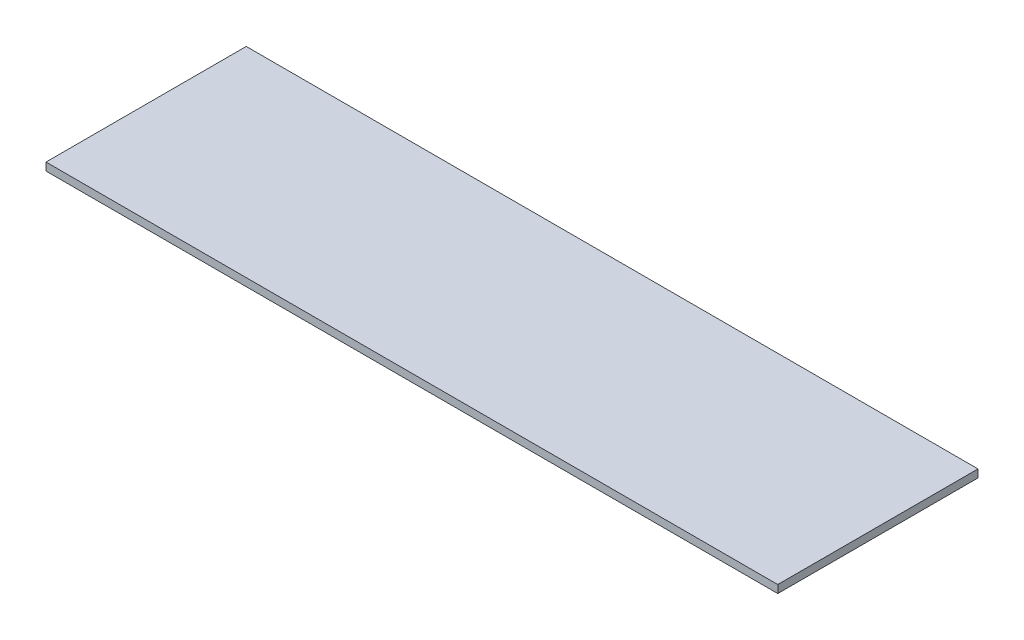
ISO-10303-21;
HEADER;
FILE_DESCRIPTION(('STEP AP214'),'2;1');
FILE_NAME('part.step','',(''),(''),'','','');
FILE_SCHEMA(('AUTOMOTIVE_DESIGN { 1 0 10303 214 1 1 1 1 }'));
ENDSEC;
DATA;
#1=APPLICATION_CONTEXT('core data for automotive mechanical design processes');
#2=APPLICATION_PROTOCOL_DEFINITION('international standard','automotive_design',2000,#1);
#3=PRODUCT_CONTEXT('',#1,'mechanical');
#4=PRODUCT('Part','Part','',(#3));
#5=PRODUCT_RELATED_PRODUCT_CATEGORY('part','',(#4));
#6=PRODUCT_DEFINITION_FORMATION('','',#4);
#7=PRODUCT_DEFINITION_CONTEXT('part definition',#1,'design');
#8=PRODUCT_DEFINITION('design','',#6,#7);
#9=PRODUCT_DEFINITION_SHAPE('','',#8);
#10=(LENGTH_UNIT() NAMED_UNIT(*) SI_UNIT(.MILLI.,.METRE.));
#11=(NAMED_UNIT(*) PLANE_ANGLE_UNIT() SI_UNIT($,.RADIAN.));
#12=(NAMED_UNIT(*) SI_UNIT($,.STERADIAN.) SOLID_ANGLE_UNIT());
#13=UNCERTAINTY_MEASURE_WITH_UNIT(LENGTH_MEASURE(1.E-05),#10,'distance_accuracy_value','');
#14=(GEOMETRIC_REPRESENTATION_CONTEXT(3) GLOBAL_UNCERTAINTY_ASSIGNED_CONTEXT((#13)) GLOBAL_UNIT_ASSIGNED_CONTEXT((#10,
#11,#12)) REPRESENTATION_CONTEXT('',''));
#15=CARTESIAN_POINT('',(0.,0.,0.));
#16=DIRECTION('',(0.,0.,1.));
#17=DIRECTION('',(1.,0.,0.));
#18=AXIS2_PLACEMENT_3D('',#15,#16,#17);
#19=CARTESIAN_POINT('',(0.,2.9972,0.));
#20=DIRECTION('',(1.,0.,0.));
#21=DIRECTION('',(0.,0.,-1.));
#22=AXIS2_PLACEMENT_3D('',#19,#20,#21);
#23=PLANE('',#22);
#24=DIRECTION('',(0.,0.,1.));
#25=VECTOR('',#24,1.);
#26=CARTESIAN_POINT('',(0.,0.,0.));
#27=LINE('',#26,#25);
#28=CARTESIAN_POINT('',(0.,0.,0.));
#29=VERTEX_POINT('',#28);
#30=CARTESIAN_POINT('',(0.,0.,76.5556));
#31=VERTEX_POINT('',#30);
#32=EDGE_CURVE('E98',#29,#31,#27,.T.);
#33=ORIENTED_EDGE('',*,*,#32,.T.);
#34=DIRECTION('',(0.,-1.,0.));
#35=VECTOR('',#34,1.);
#36=CARTESIAN_POINT('',(0.,2.9972,76.5556));
#37=LINE('',#36,#35);
#38=CARTESIAN_POINT('',(0.,2.9972,76.5556));
#39=VERTEX_POINT('',#38);
#40=EDGE_CURVE('E11',#39,#31,#37,.T.);
#41=ORIENTED_EDGE('',*,*,#40,.F.);
#42=DIRECTION('',(0.,0.,1.));
#43=VECTOR('',#42,1.);
#44=CARTESIAN_POINT('',(0.,2.9972,0.));
#45=LINE('',#44,#43);
#46=CARTESIAN_POINT('',(0.,2.9972,0.));
#47=VERTEX_POINT('',#46);
#48=EDGE_CURVE('E86',#47,#39,#45,.T.);
#49=ORIENTED_EDGE('',*,*,#48,.F.);
#50=DIRECTION('',(0.,-1.,0.));
#51=VECTOR('',#50,1.);
#52=CARTESIAN_POINT('',(0.,2.9972,0.));
#53=LINE('',#52,#51);
#54=EDGE_CURVE('E94',#47,#29,#53,.T.);
#55=ORIENTED_EDGE('',*,*,#54,.T.);
#56=EDGE_LOOP('',(#33,#41,#49,#55));
#57=FACE_BOUND('',#56,.T.);
#58=ADVANCED_FACE('F35',(#57),#23,.F.);
#59=CARTESIAN_POINT('',(0.,2.9972,76.5556));
#60=DIRECTION('',(0.,0.,-1.));
#61=DIRECTION('',(-1.,0.,0.));
#62=AXIS2_PLACEMENT_3D('',#59,#60,#61);
#63=PLANE('',#62);
#64=DIRECTION('',(1.,0.,0.));
#65=VECTOR('',#64,1.);
#66=CARTESIAN_POINT('',(0.,0.,76.5556));
#67=LINE('',#66,#65);
#68=CARTESIAN_POINT('',(279.7556,0.,76.5556));
#69=VERTEX_POINT('',#68);
#70=EDGE_CURVE('E90',#31,#69,#67,.T.);
#71=ORIENTED_EDGE('',*,*,#70,.T.);
#72=DIRECTION('',(0.,-1.,0.));
#73=VECTOR('',#72,1.);
#74=CARTESIAN_POINT('',(279.7556,2.9972,76.5556));
#75=LINE('',#74,#73);
#76=CARTESIAN_POINT('',(279.7556,2.9972,76.5556));
#77=VERTEX_POINT('',#76);
#78=EDGE_CURVE('E43',#77,#69,#75,.T.);
#79=ORIENTED_EDGE('',*,*,#78,.F.);
#80=DIRECTION('',(1.,0.,0.));
#81=VECTOR('',#80,1.);
#82=CARTESIAN_POINT('',(0.,2.9972,76.5556));
#83=LINE('',#82,#81);
#84=EDGE_CURVE('E81',#39,#77,#83,.T.);
#85=ORIENTED_EDGE('',*,*,#84,.F.);
#86=ORIENTED_EDGE('',*,*,#40,.T.);
#87=EDGE_LOOP('',(#71,#79,#85,#86));
#88=FACE_BOUND('',#87,.T.);
#89=ADVANCED_FACE('F89',(#88),#63,.F.);
#90=CARTESIAN_POINT('',(279.7556,2.9972,0.));
#91=DIRECTION('',(-1.,0.,0.));
#92=DIRECTION('',(0.,0.,1.));
#93=AXIS2_PLACEMENT_3D('',#90,#91,#92);
#94=PLANE('',#93);
#95=DIRECTION('',(0.,0.,-1.));
#96=VECTOR('',#95,1.);
#97=CARTESIAN_POINT('',(279.7556,0.,0.));
#98=LINE('',#97,#96);
#99=CARTESIAN_POINT('',(279.7556,0.,0.));
#100=VERTEX_POINT('',#99);
#101=EDGE_CURVE('E68',#69,#100,#98,.T.);
#102=ORIENTED_EDGE('',*,*,#101,.T.);
#103=DIRECTION('',(0.,-1.,0.));
#104=VECTOR('',#103,1.);
#105=CARTESIAN_POINT('',(279.7556,2.9972,0.));
#106=LINE('',#105,#104);
#107=CARTESIAN_POINT('',(279.7556,2.9972,0.));
#108=VERTEX_POINT('',#107);
#109=EDGE_CURVE('E91',#108,#100,#106,.T.);
#110=ORIENTED_EDGE('',*,*,#109,.F.);
#111=DIRECTION('',(0.,0.,-1.));
#112=VECTOR('',#111,1.);
#113=CARTESIAN_POINT('',(279.7556,2.9972,0.));
#114=LINE('',#113,#112);
#115=EDGE_CURVE('E84',#77,#108,#114,.T.);
#116=ORIENTED_EDGE('',*,*,#115,.F.);
#117=ORIENTED_EDGE('',*,*,#78,.T.);
#118=EDGE_LOOP('',(#102,#110,#116,#117));
#119=FACE_BOUND('',#118,.T.);
#120=ADVANCED_FACE('F92',(#119),#94,.F.);
#121=CARTESIAN_POINT('',(0.,2.9972,0.));
#122=DIRECTION('',(0.,0.,1.));
#123=DIRECTION('',(1.,0.,0.));
#124=AXIS2_PLACEMENT_3D('',#121,#122,#123);
#125=PLANE('',#124);
#126=DIRECTION('',(-1.,0.,0.));
#127=VECTOR('',#126,1.);
#128=CARTESIAN_POINT('',(0.,0.,0.));
#129=LINE('',#128,#127);
#130=EDGE_CURVE('E74',#100,#29,#129,.T.);
#131=ORIENTED_EDGE('',*,*,#130,.T.);
#132=ORIENTED_EDGE('',*,*,#54,.F.);
#133=DIRECTION('',(-1.,0.,0.));
#134=VECTOR('',#133,1.);
#135=CARTESIAN_POINT('',(0.,2.9972,0.));
#136=LINE('',#135,#134);
#137=EDGE_CURVE('E51',#108,#47,#136,.T.);
#138=ORIENTED_EDGE('',*,*,#137,.F.);
#139=ORIENTED_EDGE('',*,*,#109,.T.);
#140=EDGE_LOOP('',(#131,#132,#138,#139));
#141=FACE_BOUND('',#140,.T.);
#142=ADVANCED_FACE('F105',(#141),#125,.F.);
#143=CARTESIAN_POINT('',(0.,2.9972,0.));
#144=DIRECTION('',(0.,1.,0.));
#145=DIRECTION('',(0.,0.,1.));
#146=AXIS2_PLACEMENT_3D('',#143,#144,#145);
#147=PLANE('',#146);
#148=ORIENTED_EDGE('',*,*,#48,.T.);
#149=ORIENTED_EDGE('',*,*,#84,.T.);
#150=ORIENTED_EDGE('',*,*,#115,.T.);
#151=ORIENTED_EDGE('',*,*,#137,.T.);
#152=EDGE_LOOP('',(#148,#149,#150,#151));
#153=FACE_BOUND('',#152,.T.);
#154=ADVANCED_FACE('F82',(#153),#147,.T.);
#155=CARTESIAN_POINT('',(0.,0.,0.));
#156=DIRECTION('',(0.,1.,0.));
#157=DIRECTION('',(0.,0.,1.));
#158=AXIS2_PLACEMENT_3D('',#155,#156,#157);
#159=PLANE('',#158);
#160=ORIENTED_EDGE('',*,*,#32,.F.);
#161=ORIENTED_EDGE('',*,*,#130,.F.);
#162=ORIENTED_EDGE('',*,*,#101,.F.);
#163=ORIENTED_EDGE('',*,*,#70,.F.);
#164=EDGE_LOOP('',(#160,#161,#162,#163));
#165=FACE_BOUND('',#164,.T.);
#166=ADVANCED_FACE('F108',(#165),#159,.F.);
#167=CLOSED_SHELL('',(#58,#89,#120,#142,#154,#166));
#168=MANIFOLD_SOLID_BREP('B2',#167);
#169=ADVANCED_BREP_SHAPE_REPRESENTATION('',(#18,#168),#14);
#170=SHAPE_DEFINITION_REPRESENTATION(#9,#169);
ENDSEC;
END-ISO-10303-21;
